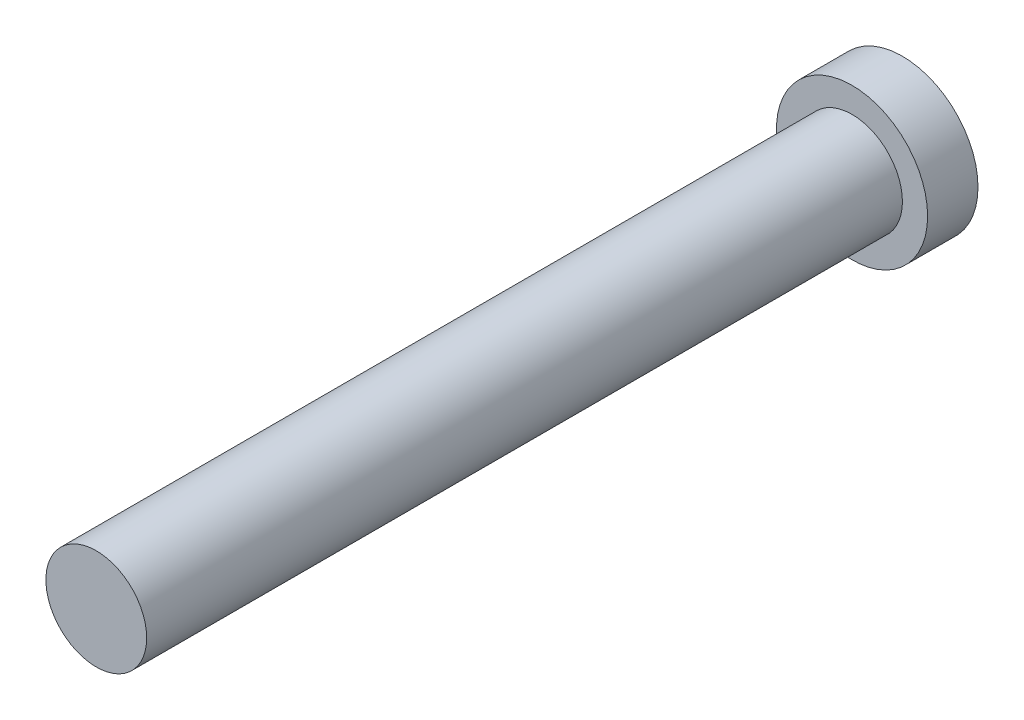
ISO-10303-21;
HEADER;
FILE_DESCRIPTION(('STEP AP214'),'2;1');
FILE_NAME('part.step','',(''),(''),'','','');
FILE_SCHEMA(('AUTOMOTIVE_DESIGN { 1 0 10303 214 1 1 1 1 }'));
ENDSEC;
DATA;
#1=APPLICATION_CONTEXT('core data for automotive mechanical design processes');
#2=APPLICATION_PROTOCOL_DEFINITION('international standard','automotive_design',2000,#1);
#3=PRODUCT_CONTEXT('',#1,'mechanical');
#4=PRODUCT('Part','Part','',(#3));
#5=PRODUCT_RELATED_PRODUCT_CATEGORY('part','',(#4));
#6=PRODUCT_DEFINITION_FORMATION('','',#4);
#7=PRODUCT_DEFINITION_CONTEXT('part definition',#1,'design');
#8=PRODUCT_DEFINITION('design','',#6,#7);
#9=PRODUCT_DEFINITION_SHAPE('','',#8);
#10=(LENGTH_UNIT() NAMED_UNIT(*) SI_UNIT(.MILLI.,.METRE.));
#11=(NAMED_UNIT(*) PLANE_ANGLE_UNIT() SI_UNIT($,.RADIAN.));
#12=(NAMED_UNIT(*) SI_UNIT($,.STERADIAN.) SOLID_ANGLE_UNIT());
#13=UNCERTAINTY_MEASURE_WITH_UNIT(LENGTH_MEASURE(1.E-05),#10,'distance_accuracy_value','');
#14=(GEOMETRIC_REPRESENTATION_CONTEXT(3) GLOBAL_UNCERTAINTY_ASSIGNED_CONTEXT((#13)) GLOBAL_UNIT_ASSIGNED_CONTEXT((#10,
#11,#12)) REPRESENTATION_CONTEXT('',''));
#15=CARTESIAN_POINT('',(0.,0.,0.));
#16=DIRECTION('',(0.,0.,1.));
#17=DIRECTION('',(1.,0.,0.));
#18=AXIS2_PLACEMENT_3D('',#15,#16,#17);
#19=CARTESIAN_POINT('',(0.,0.,2.54));
#20=DIRECTION('',(0.,0.,-1.));
#21=DIRECTION('',(-1.,0.,0.));
#22=AXIS2_PLACEMENT_3D('',#19,#20,#21);
#23=CYLINDRICAL_SURFACE('',#22,3.81);
#24=CARTESIAN_POINT('',(0.,0.,2.54));
#25=DIRECTION('',(0.,0.,1.));
#26=DIRECTION('',(1.,0.,0.));
#27=AXIS2_PLACEMENT_3D('',#24,#25,#26);
#28=CIRCLE('',#27,3.81);
#29=CARTESIAN_POINT('',(3.81,0.,2.54));
#30=VERTEX_POINT('',#29);
#31=EDGE_CURVE('E10',#30,#30,#28,.T.);
#32=ORIENTED_EDGE('',*,*,#31,.F.);
#33=EDGE_LOOP('',(#32));
#34=FACE_BOUND('',#33,.T.);
#35=CARTESIAN_POINT('',(0.,0.,0.));
#36=DIRECTION('',(0.,0.,1.));
#37=DIRECTION('',(1.,0.,0.));
#38=AXIS2_PLACEMENT_3D('',#35,#36,#37);
#39=CIRCLE('',#38,3.81);
#40=CARTESIAN_POINT('',(3.81,0.,0.));
#41=VERTEX_POINT('',#40);
#42=EDGE_CURVE('E34',#41,#41,#39,.T.);
#43=ORIENTED_EDGE('',*,*,#42,.T.);
#44=EDGE_LOOP('',(#43));
#45=FACE_BOUND('',#44,.T.);
#46=ADVANCED_FACE('F31',(#34,#45),#23,.T.);
#47=CARTESIAN_POINT('',(0.,0.,2.54));
#48=DIRECTION('',(0.,0.,1.));
#49=DIRECTION('',(1.,0.,0.));
#50=AXIS2_PLACEMENT_3D('',#47,#48,#49);
#51=PLANE('',#50);
#52=CARTESIAN_POINT('',(0.,0.,2.54));
#53=DIRECTION('',(0.,0.,1.));
#54=DIRECTION('',(1.,0.,0.));
#55=AXIS2_PLACEMENT_3D('',#52,#53,#54);
#56=CIRCLE('',#55,2.54);
#57=CARTESIAN_POINT('',(2.54,0.,2.54));
#58=VERTEX_POINT('',#57);
#59=EDGE_CURVE('E43',#58,#58,#56,.T.);
#60=ORIENTED_EDGE('',*,*,#59,.F.);
#61=EDGE_LOOP('',(#60));
#62=FACE_BOUND('',#61,.T.);
#63=ORIENTED_EDGE('',*,*,#31,.T.);
#64=EDGE_LOOP('',(#63));
#65=FACE_BOUND('',#64,.T.);
#66=ADVANCED_FACE('F58',(#62,#65),#51,.T.);
#67=CARTESIAN_POINT('',(0.,0.,0.));
#68=DIRECTION('',(0.,0.,1.));
#69=DIRECTION('',(1.,0.,0.));
#70=AXIS2_PLACEMENT_3D('',#67,#68,#69);
#71=PLANE('',#70);
#72=ORIENTED_EDGE('',*,*,#42,.F.);
#73=EDGE_LOOP('',(#72));
#74=FACE_BOUND('',#73,.T.);
#75=ADVANCED_FACE('F54',(#74),#71,.F.);
#76=CARTESIAN_POINT('',(0.,0.,40.64));
#77=DIRECTION('',(0.,0.,-1.));
#78=DIRECTION('',(-1.,0.,0.));
#79=AXIS2_PLACEMENT_3D('',#76,#77,#78);
#80=CYLINDRICAL_SURFACE('',#79,2.54);
#81=CARTESIAN_POINT('',(0.,0.,40.64));
#82=DIRECTION('',(0.,0.,1.));
#83=DIRECTION('',(1.,0.,0.));
#84=AXIS2_PLACEMENT_3D('',#81,#82,#83);
#85=CIRCLE('',#84,2.54);
#86=CARTESIAN_POINT('',(2.54,0.,40.64));
#87=VERTEX_POINT('',#86);
#88=EDGE_CURVE('E41',#87,#87,#85,.T.);
#89=ORIENTED_EDGE('',*,*,#88,.F.);
#90=EDGE_LOOP('',(#89));
#91=FACE_BOUND('',#90,.T.);
#92=ORIENTED_EDGE('',*,*,#59,.T.);
#93=EDGE_LOOP('',(#92));
#94=FACE_BOUND('',#93,.T.);
#95=ADVANCED_FACE('F51',(#91,#94),#80,.T.);
#96=CARTESIAN_POINT('',(0.,0.,40.64));
#97=DIRECTION('',(0.,0.,1.));
#98=DIRECTION('',(1.,0.,0.));
#99=AXIS2_PLACEMENT_3D('',#96,#97,#98);
#100=PLANE('',#99);
#101=ORIENTED_EDGE('',*,*,#88,.T.);
#102=EDGE_LOOP('',(#101));
#103=FACE_BOUND('',#102,.T.);
#104=ADVANCED_FACE('F49',(#103),#100,.T.);
#105=CLOSED_SHELL('',(#46,#66,#75,#95,#104));
#106=MANIFOLD_SOLID_BREP('B2',#105);
#107=ADVANCED_BREP_SHAPE_REPRESENTATION('',(#18,#106),#14);
#108=SHAPE_DEFINITION_REPRESENTATION(#9,#107);
ENDSEC;
END-ISO-10303-21;
